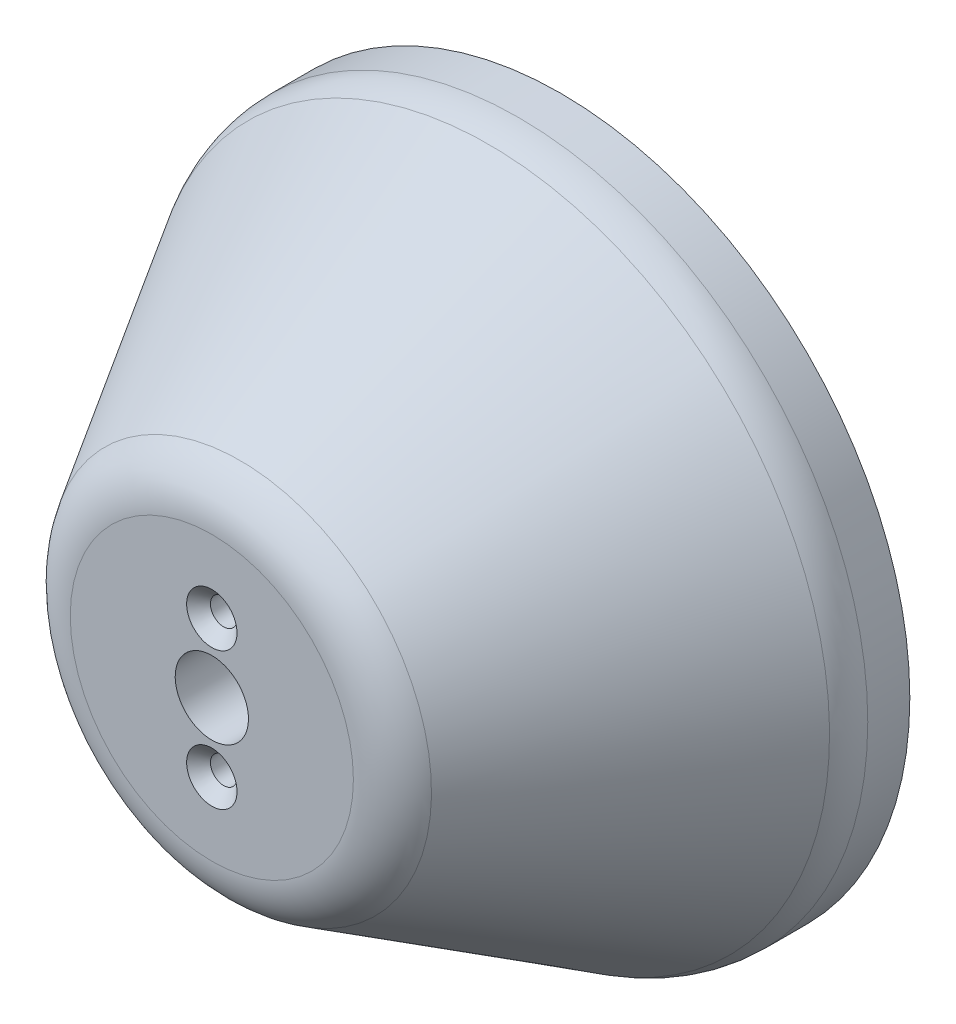
ISO-10303-21;
HEADER;
FILE_DESCRIPTION(('STEP AP214'),'2;1');
FILE_NAME('part.step','',(''),(''),'','','');
FILE_SCHEMA(('AUTOMOTIVE_DESIGN { 1 0 10303 214 1 1 1 1 }'));
ENDSEC;
DATA;
#1=APPLICATION_CONTEXT('core data for automotive mechanical design processes');
#2=APPLICATION_PROTOCOL_DEFINITION('international standard','automotive_design',2000,#1);
#3=PRODUCT_CONTEXT('',#1,'mechanical');
#4=PRODUCT('Part','Part','',(#3));
#5=PRODUCT_RELATED_PRODUCT_CATEGORY('part','',(#4));
#6=PRODUCT_DEFINITION_FORMATION('','',#4);
#7=PRODUCT_DEFINITION_CONTEXT('part definition',#1,'design');
#8=PRODUCT_DEFINITION('design','',#6,#7);
#9=PRODUCT_DEFINITION_SHAPE('','',#8);
#10=(LENGTH_UNIT() NAMED_UNIT(*) SI_UNIT(.MILLI.,.METRE.));
#11=(NAMED_UNIT(*) PLANE_ANGLE_UNIT() SI_UNIT($,.RADIAN.));
#12=(NAMED_UNIT(*) SI_UNIT($,.STERADIAN.) SOLID_ANGLE_UNIT());
#13=UNCERTAINTY_MEASURE_WITH_UNIT(LENGTH_MEASURE(1.E-05),#10,'distance_accuracy_value','');
#14=(GEOMETRIC_REPRESENTATION_CONTEXT(3) GLOBAL_UNCERTAINTY_ASSIGNED_CONTEXT((#13)) GLOBAL_UNIT_ASSIGNED_CONTEXT((#10,
#11,#12)) REPRESENTATION_CONTEXT('',''));
#15=CARTESIAN_POINT('',(0.,0.,0.));
#16=DIRECTION('',(0.,0.,1.));
#17=DIRECTION('',(1.,0.,0.));
#18=AXIS2_PLACEMENT_3D('',#15,#16,#17);
#19=CARTESIAN_POINT('',(0.,0.,38.1));
#20=DIRECTION('',(0.,0.,1.));
#21=DIRECTION('',(0.,-1.,0.));
#22=AXIS2_PLACEMENT_3D('',#19,#20,#21);
#23=PLANE('',#22);
#24=CARTESIAN_POINT('',(0.,0.,38.1));
#25=DIRECTION('',(0.,0.,1.));
#26=DIRECTION('',(0.,-1.,0.));
#27=AXIS2_PLACEMENT_3D('',#24,#25,#26);
#28=CIRCLE('',#27,15.4546910935465);
#29=CARTESIAN_POINT('',(0.,-15.4546910935465,38.1));
#30=VERTEX_POINT('',#29);
#31=EDGE_CURVE('E11',#30,#30,#28,.T.);
#32=ORIENTED_EDGE('',*,*,#31,.T.);
#33=EDGE_LOOP('',(#32));
#34=FACE_BOUND('',#33,.T.);
#35=CARTESIAN_POINT('',(0.,7.5,38.1));
#36=DIRECTION('',(0.,0.,1.));
#37=DIRECTION('',(1.,0.,0.));
#38=AXIS2_PLACEMENT_3D('',#35,#36,#37);
#39=CIRCLE('',#38,2.75);
#40=CARTESIAN_POINT('',(2.75,7.5,38.1));
#41=VERTEX_POINT('',#40);
#42=EDGE_CURVE('E120',#41,#41,#39,.T.);
#43=ORIENTED_EDGE('',*,*,#42,.F.);
#44=EDGE_LOOP('',(#43));
#45=FACE_BOUND('',#44,.T.);
#46=CARTESIAN_POINT('',(0.,-7.5,38.1));
#47=DIRECTION('',(0.,0.,1.));
#48=DIRECTION('',(1.,0.,0.));
#49=AXIS2_PLACEMENT_3D('',#46,#47,#48);
#50=CIRCLE('',#49,2.75);
#51=CARTESIAN_POINT('',(2.75,-7.5,38.1));
#52=VERTEX_POINT('',#51);
#53=EDGE_CURVE('E129',#52,#52,#50,.T.);
#54=ORIENTED_EDGE('',*,*,#53,.F.);
#55=EDGE_LOOP('',(#54));
#56=FACE_BOUND('',#55,.T.);
#57=CARTESIAN_POINT('',(0.,0.,38.1));
#58=DIRECTION('',(0.,0.,-1.));
#59=DIRECTION('',(0.,1.,0.));
#60=AXIS2_PLACEMENT_3D('',#57,#58,#59);
#61=CIRCLE('',#60,4.);
#62=CARTESIAN_POINT('',(0.,4.,38.1));
#63=VERTEX_POINT('',#62);
#64=EDGE_CURVE('E146',#63,#63,#61,.T.);
#65=ORIENTED_EDGE('',*,*,#64,.T.);
#66=EDGE_LOOP('',(#65));
#67=FACE_BOUND('',#66,.T.);
#68=ADVANCED_FACE('F44',(#34,#45,#56,#67),#23,.T.);
#69=CARTESIAN_POINT('',(0.,0.,6.35));
#70=DIRECTION('',(0.,0.,-1.));
#71=DIRECTION('',(0.,1.,0.));
#72=AXIS2_PLACEMENT_3D('',#69,#70,#71);
#73=CONICAL_SURFACE('',#72,38.1,0.540419500270584);
#74=CARTESIAN_POINT('',(0.,0.,7.85819986954223));
#75=DIRECTION('',(0.,0.,1.));
#76=DIRECTION('',(0.,-1.,0.));
#77=AXIS2_PLACEMENT_3D('',#74,#75,#76);
#78=CIRCLE('',#77,37.1950800782747);
#79=CARTESIAN_POINT('',(0.,-37.1950800782747,7.85819986954222));
#80=VERTEX_POINT('',#79);
#81=EDGE_CURVE('E53',#80,#80,#78,.T.);
#82=ORIENTED_EDGE('',*,*,#81,.T.);
#83=EDGE_LOOP('',(#82));
#84=FACE_BOUND('',#83,.T.);
#85=CARTESIAN_POINT('',(0.,0.,35.0170480469648));
#86=DIRECTION('',(0.,0.,1.));
#87=DIRECTION('',(0.,-1.,0.));
#88=AXIS2_PLACEMENT_3D('',#85,#86,#87);
#89=CIRCLE('',#88,20.8997711718211);
#90=CARTESIAN_POINT('',(0.,-20.8997711718211,35.0170480469648));
#91=VERTEX_POINT('',#90);
#92=EDGE_CURVE('E232',#91,#91,#89,.F.);
#93=ORIENTED_EDGE('',*,*,#92,.T.);
#94=EDGE_LOOP('',(#93));
#95=FACE_BOUND('',#94,.T.);
#96=ADVANCED_FACE('F240',(#84,#95),#73,.T.);
#97=CARTESIAN_POINT('',(0.,0.,0.));
#98=DIRECTION('',(0.,0.,-1.));
#99=DIRECTION('',(0.,1.,0.));
#100=AXIS2_PLACEMENT_3D('',#97,#98,#99);
#101=CYLINDRICAL_SURFACE('',#100,38.1);
#102=CARTESIAN_POINT('',(0.,0.,4.59115182257744));
#103=DIRECTION('',(0.,0.,1.));
#104=DIRECTION('',(0.,-1.,0.));
#105=AXIS2_PLACEMENT_3D('',#102,#103,#104);
#106=CIRCLE('',#105,38.1);
#107=CARTESIAN_POINT('',(0.,-38.1,4.59115182257744));
#108=VERTEX_POINT('',#107);
#109=EDGE_CURVE('E228',#108,#108,#106,.F.);
#110=ORIENTED_EDGE('',*,*,#109,.T.);
#111=EDGE_LOOP('',(#110));
#112=FACE_BOUND('',#111,.T.);
#113=CARTESIAN_POINT('',(0.,0.,0.));
#114=DIRECTION('',(0.,0.,-1.));
#115=DIRECTION('',(0.,1.,0.));
#116=AXIS2_PLACEMENT_3D('',#113,#114,#115);
#117=CIRCLE('',#116,38.1);
#118=CARTESIAN_POINT('',(0.,38.1,0.));
#119=VERTEX_POINT('',#118);
#120=EDGE_CURVE('E154',#119,#119,#117,.T.);
#121=ORIENTED_EDGE('',*,*,#120,.F.);
#122=EDGE_LOOP('',(#121));
#123=FACE_BOUND('',#122,.T.);
#124=ADVANCED_FACE('F249',(#112,#123),#101,.T.);
#125=CARTESIAN_POINT('',(0.,38.1,0.));
#126=DIRECTION('',(0.,0.,-1.));
#127=DIRECTION('',(0.,1.,0.));
#128=AXIS2_PLACEMENT_3D('',#125,#126,#127);
#129=PLANE('',#128);
#130=CARTESIAN_POINT('',(-28.5114292872175,-6.3499999999997,0.));
#131=DIRECTION('',(0.,0.,-1.));
#132=DIRECTION('',(0.,1.,0.));
#133=AXIS2_PLACEMENT_3D('',#130,#131,#132);
#134=CIRCLE('',#133,3.27917572527012);
#135=CARTESIAN_POINT('',(-28.5114292872175,-3.07082427472958,0.));
#136=VERTEX_POINT('',#135);
#137=EDGE_CURVE('E220',#136,#136,#134,.F.);
#138=ORIENTED_EDGE('',*,*,#137,.T.);
#139=EDGE_LOOP('',(#138));
#140=FACE_BOUND('',#139,.T.);
#141=CARTESIAN_POINT('',(-28.5114292872174,6.3500000000003,0.));
#142=DIRECTION('',(0.,0.,-1.));
#143=DIRECTION('',(0.,1.,0.));
#144=AXIS2_PLACEMENT_3D('',#141,#142,#143);
#145=CIRCLE('',#144,3.27917572527012);
#146=CARTESIAN_POINT('',(-28.5114292872174,9.62917572527042,0.));
#147=VERTEX_POINT('',#146);
#148=EDGE_CURVE('E216',#147,#147,#145,.F.);
#149=ORIENTED_EDGE('',*,*,#148,.T.);
#150=EDGE_LOOP('',(#149));
#151=FACE_BOUND('',#150,.T.);
#152=CARTESIAN_POINT('',(6.35,-28.5114292872174,0.));
#153=DIRECTION('',(0.,0.,-1.));
#154=DIRECTION('',(0.,1.,0.));
#155=AXIS2_PLACEMENT_3D('',#152,#153,#154);
#156=CIRCLE('',#155,3.27917572527013);
#157=CARTESIAN_POINT('',(6.35,-25.2322535619473,0.));
#158=VERTEX_POINT('',#157);
#159=EDGE_CURVE('E204',#158,#158,#156,.F.);
#160=ORIENTED_EDGE('',*,*,#159,.T.);
#161=EDGE_LOOP('',(#160));
#162=FACE_BOUND('',#161,.T.);
#163=CARTESIAN_POINT('',(-6.35,-28.5114292872174,0.));
#164=DIRECTION('',(0.,0.,-1.));
#165=DIRECTION('',(0.,1.,0.));
#166=AXIS2_PLACEMENT_3D('',#163,#164,#165);
#167=CIRCLE('',#166,3.27917572527012);
#168=CARTESIAN_POINT('',(-6.35,-25.2322535619473,0.));
#169=VERTEX_POINT('',#168);
#170=EDGE_CURVE('E200',#169,#169,#167,.F.);
#171=ORIENTED_EDGE('',*,*,#170,.T.);
#172=EDGE_LOOP('',(#171));
#173=FACE_BOUND('',#172,.T.);
#174=CARTESIAN_POINT('',(28.5114292872174,6.3499999999999,0.));
#175=DIRECTION('',(0.,0.,-1.));
#176=DIRECTION('',(0.,1.,0.));
#177=AXIS2_PLACEMENT_3D('',#174,#175,#176);
#178=CIRCLE('',#177,3.27917572527012);
#179=CARTESIAN_POINT('',(28.5114292872174,9.62917572527003,0.));
#180=VERTEX_POINT('',#179);
#181=EDGE_CURVE('E188',#180,#180,#178,.F.);
#182=ORIENTED_EDGE('',*,*,#181,.T.);
#183=EDGE_LOOP('',(#182));
#184=FACE_BOUND('',#183,.T.);
#185=CARTESIAN_POINT('',(28.5114292872174,-6.3500000000001,0.));
#186=DIRECTION('',(0.,0.,-1.));
#187=DIRECTION('',(0.,1.,0.));
#188=AXIS2_PLACEMENT_3D('',#185,#186,#187);
#189=CIRCLE('',#188,3.27917572527012);
#190=CARTESIAN_POINT('',(28.5114292872174,-3.07082427472997,0.));
#191=VERTEX_POINT('',#190);
#192=EDGE_CURVE('E184',#191,#191,#189,.F.);
#193=ORIENTED_EDGE('',*,*,#192,.T.);
#194=EDGE_LOOP('',(#193));
#195=FACE_BOUND('',#194,.T.);
#196=CARTESIAN_POINT('',(-6.35,28.5114292872174,0.));
#197=DIRECTION('',(0.,0.,-1.));
#198=DIRECTION('',(0.,1.,0.));
#199=AXIS2_PLACEMENT_3D('',#196,#197,#198);
#200=CIRCLE('',#199,3.27917572527012);
#201=CARTESIAN_POINT('',(-6.35,31.7906050124875,0.));
#202=VERTEX_POINT('',#201);
#203=EDGE_CURVE('E172',#202,#202,#200,.F.);
#204=ORIENTED_EDGE('',*,*,#203,.T.);
#205=EDGE_LOOP('',(#204));
#206=FACE_BOUND('',#205,.T.);
#207=CARTESIAN_POINT('',(6.35,28.5114292872174,0.));
#208=DIRECTION('',(0.,0.,-1.));
#209=DIRECTION('',(0.,1.,0.));
#210=AXIS2_PLACEMENT_3D('',#207,#208,#209);
#211=CIRCLE('',#210,3.27917572527012);
#212=CARTESIAN_POINT('',(6.35,31.7906050124876,0.));
#213=VERTEX_POINT('',#212);
#214=EDGE_CURVE('E168',#213,#213,#211,.F.);
#215=ORIENTED_EDGE('',*,*,#214,.T.);
#216=EDGE_LOOP('',(#215));
#217=FACE_BOUND('',#216,.T.);
#218=CARTESIAN_POINT('',(0.,0.,0.));
#219=DIRECTION('',(0.,0.,-1.));
#220=DIRECTION('',(0.,1.,0.));
#221=AXIS2_PLACEMENT_3D('',#218,#219,#220);
#222=CIRCLE('',#221,14.2875);
#223=CARTESIAN_POINT('',(0.,14.2875,0.));
#224=VERTEX_POINT('',#223);
#225=EDGE_CURVE('E150',#224,#224,#222,.T.);
#226=ORIENTED_EDGE('',*,*,#225,.F.);
#227=EDGE_LOOP('',(#226));
#228=FACE_BOUND('',#227,.T.);
#229=ORIENTED_EDGE('',*,*,#120,.T.);
#230=EDGE_LOOP('',(#229));
#231=FACE_BOUND('',#230,.T.);
#232=ADVANCED_FACE('F252',(#140,#151,#162,#173,#184,#195,#206,#217,#228,#231),#129,.T.);
#233=CARTESIAN_POINT('',(0.,0.,0.));
#234=DIRECTION('',(0.,0.,-1.));
#235=DIRECTION('',(0.,1.,0.));
#236=AXIS2_PLACEMENT_3D('',#233,#234,#235);
#237=CYLINDRICAL_SURFACE('',#236,14.2875);
#238=CARTESIAN_POINT('',(0.,0.,31.75));
#239=DIRECTION('',(0.,0.,-1.));
#240=DIRECTION('',(0.,1.,0.));
#241=AXIS2_PLACEMENT_3D('',#238,#239,#240);
#242=CIRCLE('',#241,14.2875);
#243=CARTESIAN_POINT('',(0.,14.2875,31.75));
#244=VERTEX_POINT('',#243);
#245=EDGE_CURVE('E138',#244,#244,#242,.T.);
#246=ORIENTED_EDGE('',*,*,#245,.F.);
#247=EDGE_LOOP('',(#246));
#248=FACE_BOUND('',#247,.T.);
#249=ORIENTED_EDGE('',*,*,#225,.T.);
#250=EDGE_LOOP('',(#249));
#251=FACE_BOUND('',#250,.T.);
#252=ADVANCED_FACE('F257',(#248,#251),#237,.F.);
#253=CARTESIAN_POINT('',(0.,0.,0.));
#254=DIRECTION('',(0.,0.,-1.));
#255=DIRECTION('',(0.,1.,0.));
#256=AXIS2_PLACEMENT_3D('',#253,#254,#255);
#257=CYLINDRICAL_SURFACE('',#256,4.);
#258=ORIENTED_EDGE('',*,*,#64,.F.);
#259=EDGE_LOOP('',(#258));
#260=FACE_BOUND('',#259,.T.);
#261=CARTESIAN_POINT('',(0.,0.,31.75));
#262=DIRECTION('',(0.,0.,-1.));
#263=DIRECTION('',(0.,1.,0.));
#264=AXIS2_PLACEMENT_3D('',#261,#262,#263);
#265=CIRCLE('',#264,4.);
#266=CARTESIAN_POINT('',(0.,4.,31.75));
#267=VERTEX_POINT('',#266);
#268=EDGE_CURVE('E142',#267,#267,#265,.T.);
#269=ORIENTED_EDGE('',*,*,#268,.T.);
#270=EDGE_LOOP('',(#269));
#271=FACE_BOUND('',#270,.T.);
#272=ADVANCED_FACE('F263',(#260,#271),#257,.F.);
#273=CARTESIAN_POINT('',(0.,14.2875,31.75));
#274=DIRECTION('',(0.,0.,1.));
#275=DIRECTION('',(0.,-1.,0.));
#276=AXIS2_PLACEMENT_3D('',#273,#274,#275);
#277=PLANE('',#276);
#278=CARTESIAN_POINT('',(0.,7.5,31.75));
#279=DIRECTION('',(0.,0.,1.));
#280=DIRECTION('',(0.,-1.,0.));
#281=AXIS2_PLACEMENT_3D('',#278,#279,#280);
#282=CIRCLE('',#281,1.44999999999999);
#283=CARTESIAN_POINT('',(0.,6.05000000000001,31.75));
#284=VERTEX_POINT('',#283);
#285=EDGE_CURVE('E128',#284,#284,#282,.T.);
#286=ORIENTED_EDGE('',*,*,#285,.T.);
#287=EDGE_LOOP('',(#286));
#288=FACE_BOUND('',#287,.T.);
#289=CARTESIAN_POINT('',(0.,-7.5,31.75));
#290=DIRECTION('',(0.,0.,1.));
#291=DIRECTION('',(0.,-1.,0.));
#292=AXIS2_PLACEMENT_3D('',#289,#290,#291);
#293=CIRCLE('',#292,1.44999999999999);
#294=CARTESIAN_POINT('',(0.,-8.94999999999999,31.75));
#295=VERTEX_POINT('',#294);
#296=EDGE_CURVE('E137',#295,#295,#293,.T.);
#297=ORIENTED_EDGE('',*,*,#296,.T.);
#298=EDGE_LOOP('',(#297));
#299=FACE_BOUND('',#298,.T.);
#300=ORIENTED_EDGE('',*,*,#268,.F.);
#301=EDGE_LOOP('',(#300));
#302=FACE_BOUND('',#301,.T.);
#303=ORIENTED_EDGE('',*,*,#245,.T.);
#304=EDGE_LOOP('',(#303));
#305=FACE_BOUND('',#304,.T.);
#306=ADVANCED_FACE('F409',(#288,#299,#302,#305),#277,.F.);
#307=CARTESIAN_POINT('',(0.,-7.5,38.1));
#308=DIRECTION('',(0.,0.,1.));
#309=DIRECTION('',(1.,0.,0.));
#310=AXIS2_PLACEMENT_3D('',#307,#308,#309);
#311=CYLINDRICAL_SURFACE('',#310,1.44999999999999);
#312=CARTESIAN_POINT('',(0.,-7.5,36.8));
#313=DIRECTION('',(0.,0.,1.));
#314=DIRECTION('',(1.,0.,0.));
#315=AXIS2_PLACEMENT_3D('',#312,#313,#314);
#316=CIRCLE('',#315,1.44999999999999);
#317=CARTESIAN_POINT('',(1.44999999999999,-7.5,36.8));
#318=VERTEX_POINT('',#317);
#319=EDGE_CURVE('E133',#318,#318,#316,.T.);
#320=ORIENTED_EDGE('',*,*,#319,.T.);
#321=EDGE_LOOP('',(#320));
#322=FACE_BOUND('',#321,.T.);
#323=ORIENTED_EDGE('',*,*,#296,.F.);
#324=EDGE_LOOP('',(#323));
#325=FACE_BOUND('',#324,.T.);
#326=ADVANCED_FACE('F405',(#322,#325),#311,.F.);
#327=CARTESIAN_POINT('',(0.,-7.5,38.1));
#328=DIRECTION('',(0.,0.,1.));
#329=DIRECTION('',(1.,0.,0.));
#330=AXIS2_PLACEMENT_3D('',#327,#328,#329);
#331=CONICAL_SURFACE('',#330,2.75,0.785398163397449);
#332=ORIENTED_EDGE('',*,*,#319,.F.);
#333=EDGE_LOOP('',(#332));
#334=FACE_BOUND('',#333,.T.);
#335=ORIENTED_EDGE('',*,*,#53,.T.);
#336=EDGE_LOOP('',(#335));
#337=FACE_BOUND('',#336,.T.);
#338=ADVANCED_FACE('F401',(#334,#337),#331,.F.);
#339=CARTESIAN_POINT('',(0.,7.5,38.1));
#340=DIRECTION('',(0.,0.,1.));
#341=DIRECTION('',(1.,0.,0.));
#342=AXIS2_PLACEMENT_3D('',#339,#340,#341);
#343=CYLINDRICAL_SURFACE('',#342,1.44999999999999);
#344=CARTESIAN_POINT('',(0.,7.5,36.8));
#345=DIRECTION('',(0.,0.,1.));
#346=DIRECTION('',(1.,0.,0.));
#347=AXIS2_PLACEMENT_3D('',#344,#345,#346);
#348=CIRCLE('',#347,1.44999999999999);
#349=CARTESIAN_POINT('',(1.44999999999999,7.5,36.8));
#350=VERTEX_POINT('',#349);
#351=EDGE_CURVE('E124',#350,#350,#348,.T.);
#352=ORIENTED_EDGE('',*,*,#351,.T.);
#353=EDGE_LOOP('',(#352));
#354=FACE_BOUND('',#353,.T.);
#355=ORIENTED_EDGE('',*,*,#285,.F.);
#356=EDGE_LOOP('',(#355));
#357=FACE_BOUND('',#356,.T.);
#358=ADVANCED_FACE('F397',(#354,#357),#343,.F.);
#359=CARTESIAN_POINT('',(0.,7.5,38.1));
#360=DIRECTION('',(0.,0.,1.));
#361=DIRECTION('',(1.,0.,0.));
#362=AXIS2_PLACEMENT_3D('',#359,#360,#361);
#363=CONICAL_SURFACE('',#362,2.75,0.785398163397449);
#364=ORIENTED_EDGE('',*,*,#351,.F.);
#365=EDGE_LOOP('',(#364));
#366=FACE_BOUND('',#365,.T.);
#367=ORIENTED_EDGE('',*,*,#42,.T.);
#368=EDGE_LOOP('',(#367));
#369=FACE_BOUND('',#368,.T.);
#370=ADVANCED_FACE('F394',(#366,#369),#363,.F.);
#371=CARTESIAN_POINT('',(-6.35,28.5114292872174,9.525));
#372=DIRECTION('',(0.,0.,-1.));
#373=DIRECTION('',(0.,1.,0.));
#374=AXIS2_PLACEMENT_3D('',#371,#372,#373);
#375=CONICAL_SURFACE('',#374,2.60985,1.02974425867665);
#376=CARTESIAN_POINT('',(-6.35,28.5114292872174,11.0931560865691));
#377=VERTEX_POINT('',#376);
#378=VERTEX_LOOP('',#377);
#379=FACE_BOUND('',#378,.T.);
#380=CARTESIAN_POINT('',(-6.35,28.5114292872174,9.525));
#381=DIRECTION('',(0.,0.,-1.));
#382=DIRECTION('',(0.,1.,0.));
#383=AXIS2_PLACEMENT_3D('',#380,#381,#382);
#384=CIRCLE('',#383,2.60985);
#385=CARTESIAN_POINT('',(-6.35,31.1212792872174,9.525));
#386=VERTEX_POINT('',#385);
#387=EDGE_CURVE('E116',#386,#386,#384,.T.);
#388=ORIENTED_EDGE('',*,*,#387,.T.);
#389=EDGE_LOOP('',(#388));
#390=FACE_BOUND('',#389,.T.);
#391=ADVANCED_FACE('F390',(#379,#390),#375,.F.);
#392=CARTESIAN_POINT('',(-6.35,28.5114292872174,0.));
#393=DIRECTION('',(0.,0.,-1.));
#394=DIRECTION('',(0.,1.,0.));
#395=AXIS2_PLACEMENT_3D('',#392,#393,#394);
#396=CYLINDRICAL_SURFACE('',#395,2.60985);
#397=CARTESIAN_POINT('',(-6.35,28.5114292872174,4.76250000000002));
#398=DIRECTION('',(0.,0.,-1.));
#399=DIRECTION('',(-1.,0.,0.));
#400=AXIS2_PLACEMENT_3D('',#397,#398,#399);
#401=CIRCLE('',#400,2.60985);
#402=CARTESIAN_POINT('',(-8.95985,28.5114292872174,4.76250000000002));
#403=VERTEX_POINT('',#402);
#404=EDGE_CURVE('E158',#403,#403,#401,.T.);
#405=ORIENTED_EDGE('',*,*,#404,.T.);
#406=EDGE_LOOP('',(#405));
#407=FACE_BOUND('',#406,.T.);
#408=ORIENTED_EDGE('',*,*,#387,.F.);
#409=EDGE_LOOP('',(#408));
#410=FACE_BOUND('',#409,.T.);
#411=ADVANCED_FACE('F387',(#407,#410),#396,.F.);
#412=CARTESIAN_POINT('',(6.35,28.5114292872174,9.525));
#413=DIRECTION('',(0.,0.,-1.));
#414=DIRECTION('',(0.,1.,0.));
#415=AXIS2_PLACEMENT_3D('',#412,#413,#414);
#416=CONICAL_SURFACE('',#415,2.60985,1.02974425867665);
#417=CARTESIAN_POINT('',(6.35,28.5114292872174,11.0931560865691));
#418=VERTEX_POINT('',#417);
#419=VERTEX_LOOP('',#418);
#420=FACE_BOUND('',#419,.T.);
#421=CARTESIAN_POINT('',(6.35,28.5114292872174,9.525));
#422=DIRECTION('',(0.,0.,-1.));
#423=DIRECTION('',(0.,1.,0.));
#424=AXIS2_PLACEMENT_3D('',#421,#422,#423);
#425=CIRCLE('',#424,2.60985);
#426=CARTESIAN_POINT('',(6.35,31.1212792872174,9.525));
#427=VERTEX_POINT('',#426);
#428=EDGE_CURVE('E112',#427,#427,#425,.T.);
#429=ORIENTED_EDGE('',*,*,#428,.T.);
#430=EDGE_LOOP('',(#429));
#431=FACE_BOUND('',#430,.T.);
#432=ADVANCED_FACE('F383',(#420,#431),#416,.F.);
#433=CARTESIAN_POINT('',(6.35,28.5114292872174,0.));
#434=DIRECTION('',(0.,0.,-1.));
#435=DIRECTION('',(0.,1.,0.));
#436=AXIS2_PLACEMENT_3D('',#433,#434,#435);
#437=CYLINDRICAL_SURFACE('',#436,2.60985);
#438=CARTESIAN_POINT('',(6.35,28.5114292872174,4.76250000000002));
#439=DIRECTION('',(0.,0.,-1.));
#440=DIRECTION('',(-1.,0.,0.));
#441=AXIS2_PLACEMENT_3D('',#438,#439,#440);
#442=CIRCLE('',#441,2.60985);
#443=CARTESIAN_POINT('',(3.74015,28.5114292872174,4.76250000000002));
#444=VERTEX_POINT('',#443);
#445=EDGE_CURVE('E176',#444,#444,#442,.T.);
#446=ORIENTED_EDGE('',*,*,#445,.T.);
#447=EDGE_LOOP('',(#446));
#448=FACE_BOUND('',#447,.T.);
#449=ORIENTED_EDGE('',*,*,#428,.F.);
#450=EDGE_LOOP('',(#449));
#451=FACE_BOUND('',#450,.T.);
#452=ADVANCED_FACE('F284',(#448,#451),#437,.F.);
#453=CARTESIAN_POINT('',(-6.35,28.5114292872174,4.76250000000002));
#454=DIRECTION('',(0.,0.,-1.));
#455=DIRECTION('',(-1.,0.,0.));
#456=AXIS2_PLACEMENT_3D('',#453,#454,#455);
#457=CONICAL_SURFACE('',#456,2.60985,0.139626340159542);
#458=ORIENTED_EDGE('',*,*,#203,.F.);
#459=EDGE_LOOP('',(#458));
#460=FACE_BOUND('',#459,.T.);
#461=ORIENTED_EDGE('',*,*,#404,.F.);
#462=EDGE_LOOP('',(#461));
#463=FACE_BOUND('',#462,.T.);
#464=ADVANCED_FACE('F277',(#460,#463),#457,.F.);
#465=CARTESIAN_POINT('',(6.35,28.5114292872174,4.76250000000002));
#466=DIRECTION('',(0.,0.,-1.));
#467=DIRECTION('',(-1.,0.,0.));
#468=AXIS2_PLACEMENT_3D('',#465,#466,#467);
#469=CONICAL_SURFACE('',#468,2.60985,0.139626340159543);
#470=ORIENTED_EDGE('',*,*,#214,.F.);
#471=EDGE_LOOP('',(#470));
#472=FACE_BOUND('',#471,.T.);
#473=ORIENTED_EDGE('',*,*,#445,.F.);
#474=EDGE_LOOP('',(#473));
#475=FACE_BOUND('',#474,.T.);
#476=ADVANCED_FACE('F283',(#472,#475),#469,.F.);
#477=CARTESIAN_POINT('',(28.5114292872174,6.3499999999999,9.525));
#478=DIRECTION('',(0.,0.,-1.));
#479=DIRECTION('',(0.,1.,0.));
#480=AXIS2_PLACEMENT_3D('',#477,#478,#479);
#481=CONICAL_SURFACE('',#480,2.60985,1.02974425867665);
#482=CARTESIAN_POINT('',(28.5114292872174,6.3499999999999,11.0931560865691));
#483=VERTEX_POINT('',#482);
#484=VERTEX_LOOP('',#483);
#485=FACE_BOUND('',#484,.T.);
#486=CARTESIAN_POINT('',(28.5114292872174,6.3499999999999,9.525));
#487=DIRECTION('',(0.,0.,-1.));
#488=DIRECTION('',(0.,1.,0.));
#489=AXIS2_PLACEMENT_3D('',#486,#487,#488);
#490=CIRCLE('',#489,2.60985);
#491=CARTESIAN_POINT('',(28.5114292872174,8.9598499999999,9.525));
#492=VERTEX_POINT('',#491);
#493=EDGE_CURVE('E108',#492,#492,#490,.T.);
#494=ORIENTED_EDGE('',*,*,#493,.T.);
#495=EDGE_LOOP('',(#494));
#496=FACE_BOUND('',#495,.T.);
#497=ADVANCED_FACE('F291',(#485,#496),#481,.F.);
#498=CARTESIAN_POINT('',(28.5114292872174,6.3499999999999,0.));
#499=DIRECTION('',(0.,0.,-1.));
#500=DIRECTION('',(0.,1.,0.));
#501=AXIS2_PLACEMENT_3D('',#498,#499,#500);
#502=CYLINDRICAL_SURFACE('',#501,2.60985);
#503=CARTESIAN_POINT('',(28.5114292872174,6.3499999999999,4.76250000000001));
#504=DIRECTION('',(0.,0.,-1.));
#505=DIRECTION('',(0.,1.,0.));
#506=AXIS2_PLACEMENT_3D('',#503,#504,#505);
#507=CIRCLE('',#506,2.60985);
#508=CARTESIAN_POINT('',(28.5114292872174,8.9598499999999,4.76250000000001));
#509=VERTEX_POINT('',#508);
#510=EDGE_CURVE('E180',#509,#509,#507,.T.);
#511=ORIENTED_EDGE('',*,*,#510,.T.);
#512=EDGE_LOOP('',(#511));
#513=FACE_BOUND('',#512,.T.);
#514=ORIENTED_EDGE('',*,*,#493,.F.);
#515=EDGE_LOOP('',(#514));
#516=FACE_BOUND('',#515,.T.);
#517=ADVANCED_FACE('F373',(#513,#516),#502,.F.);
#518=CARTESIAN_POINT('',(28.5114292872174,-6.3500000000001,9.525));
#519=DIRECTION('',(0.,0.,-1.));
#520=DIRECTION('',(0.,1.,0.));
#521=AXIS2_PLACEMENT_3D('',#518,#519,#520);
#522=CONICAL_SURFACE('',#521,2.60985,1.02974425867665);
#523=CARTESIAN_POINT('',(28.5114292872174,-6.3500000000001,11.0931560865691));
#524=VERTEX_POINT('',#523);
#525=VERTEX_LOOP('',#524);
#526=FACE_BOUND('',#525,.T.);
#527=CARTESIAN_POINT('',(28.5114292872174,-6.3500000000001,9.525));
#528=DIRECTION('',(0.,0.,-1.));
#529=DIRECTION('',(0.,1.,0.));
#530=AXIS2_PLACEMENT_3D('',#527,#528,#529);
#531=CIRCLE('',#530,2.60985);
#532=CARTESIAN_POINT('',(28.5114292872174,-3.7401500000001,9.525));
#533=VERTEX_POINT('',#532);
#534=EDGE_CURVE('E104',#533,#533,#531,.T.);
#535=ORIENTED_EDGE('',*,*,#534,.T.);
#536=EDGE_LOOP('',(#535));
#537=FACE_BOUND('',#536,.T.);
#538=ADVANCED_FACE('F369',(#526,#537),#522,.F.);
#539=CARTESIAN_POINT('',(28.5114292872174,-6.3500000000001,0.));
#540=DIRECTION('',(0.,0.,-1.));
#541=DIRECTION('',(0.,1.,0.));
#542=AXIS2_PLACEMENT_3D('',#539,#540,#541);
#543=CYLINDRICAL_SURFACE('',#542,2.60985);
#544=CARTESIAN_POINT('',(28.5114292872174,-6.3500000000001,4.76250000000002));
#545=DIRECTION('',(0.,0.,-1.));
#546=DIRECTION('',(0.,1.,0.));
#547=AXIS2_PLACEMENT_3D('',#544,#545,#546);
#548=CIRCLE('',#547,2.60985);
#549=CARTESIAN_POINT('',(28.5114292872174,-3.7401500000001,4.76250000000002));
#550=VERTEX_POINT('',#549);
#551=EDGE_CURVE('E192',#550,#550,#548,.T.);
#552=ORIENTED_EDGE('',*,*,#551,.T.);
#553=EDGE_LOOP('',(#552));
#554=FACE_BOUND('',#553,.T.);
#555=ORIENTED_EDGE('',*,*,#534,.F.);
#556=EDGE_LOOP('',(#555));
#557=FACE_BOUND('',#556,.T.);
#558=ADVANCED_FACE('F365',(#554,#557),#543,.F.);
#559=CARTESIAN_POINT('',(6.35,-28.5114292872174,9.525));
#560=DIRECTION('',(0.,0.,-1.));
#561=DIRECTION('',(0.,1.,0.));
#562=AXIS2_PLACEMENT_3D('',#559,#560,#561);
#563=CONICAL_SURFACE('',#562,2.60985,1.02974425867665);
#564=CARTESIAN_POINT('',(6.35,-28.5114292872174,11.0931560865691));
#565=VERTEX_POINT('',#564);
#566=VERTEX_LOOP('',#565);
#567=FACE_BOUND('',#566,.T.);
#568=CARTESIAN_POINT('',(6.35,-28.5114292872174,9.525));
#569=DIRECTION('',(0.,0.,-1.));
#570=DIRECTION('',(0.,1.,0.));
#571=AXIS2_PLACEMENT_3D('',#568,#569,#570);
#572=CIRCLE('',#571,2.60985);
#573=CARTESIAN_POINT('',(6.35,-25.9015792872174,9.525));
#574=VERTEX_POINT('',#573);
#575=EDGE_CURVE('E100',#574,#574,#572,.T.);
#576=ORIENTED_EDGE('',*,*,#575,.T.);
#577=EDGE_LOOP('',(#576));
#578=FACE_BOUND('',#577,.T.);
#579=ADVANCED_FACE('F361',(#567,#578),#563,.F.);
#580=CARTESIAN_POINT('',(6.35,-28.5114292872174,0.));
#581=DIRECTION('',(0.,0.,-1.));
#582=DIRECTION('',(0.,1.,0.));
#583=AXIS2_PLACEMENT_3D('',#580,#581,#582);
#584=CYLINDRICAL_SURFACE('',#583,2.60985);
#585=CARTESIAN_POINT('',(6.35,-28.5114292872174,4.76250000000001));
#586=DIRECTION('',(0.,0.,-1.));
#587=DIRECTION('',(-1.,0.,0.));
#588=AXIS2_PLACEMENT_3D('',#585,#586,#587);
#589=CIRCLE('',#588,2.60985);
#590=CARTESIAN_POINT('',(3.74015,-28.5114292872174,4.76250000000001));
#591=VERTEX_POINT('',#590);
#592=EDGE_CURVE('E196',#591,#591,#589,.T.);
#593=ORIENTED_EDGE('',*,*,#592,.T.);
#594=EDGE_LOOP('',(#593));
#595=FACE_BOUND('',#594,.T.);
#596=ORIENTED_EDGE('',*,*,#575,.F.);
#597=EDGE_LOOP('',(#596));
#598=FACE_BOUND('',#597,.T.);
#599=ADVANCED_FACE('F357',(#595,#598),#584,.F.);
#600=CARTESIAN_POINT('',(-6.35,-28.5114292872174,9.525));
#601=DIRECTION('',(0.,0.,-1.));
#602=DIRECTION('',(0.,1.,0.));
#603=AXIS2_PLACEMENT_3D('',#600,#601,#602);
#604=CONICAL_SURFACE('',#603,2.60985,1.02974425867665);
#605=CARTESIAN_POINT('',(-6.35,-28.5114292872174,11.0931560865691));
#606=VERTEX_POINT('',#605);
#607=VERTEX_LOOP('',#606);
#608=FACE_BOUND('',#607,.T.);
#609=CARTESIAN_POINT('',(-6.35,-28.5114292872174,9.525));
#610=DIRECTION('',(0.,0.,-1.));
#611=DIRECTION('',(0.,1.,0.));
#612=AXIS2_PLACEMENT_3D('',#609,#610,#611);
#613=CIRCLE('',#612,2.60985);
#614=CARTESIAN_POINT('',(-6.35,-25.9015792872174,9.525));
#615=VERTEX_POINT('',#614);
#616=EDGE_CURVE('E94',#615,#615,#613,.T.);
#617=ORIENTED_EDGE('',*,*,#616,.T.);
#618=EDGE_LOOP('',(#617));
#619=FACE_BOUND('',#618,.T.);
#620=ADVANCED_FACE('F353',(#608,#619),#604,.F.);
#621=CARTESIAN_POINT('',(-6.35,-28.5114292872174,0.));
#622=DIRECTION('',(0.,0.,-1.));
#623=DIRECTION('',(0.,1.,0.));
#624=AXIS2_PLACEMENT_3D('',#621,#622,#623);
#625=CYLINDRICAL_SURFACE('',#624,2.60985);
#626=CARTESIAN_POINT('',(-6.35,-28.5114292872174,4.76250000000002));
#627=DIRECTION('',(0.,0.,-1.));
#628=DIRECTION('',(-1.,0.,0.));
#629=AXIS2_PLACEMENT_3D('',#626,#627,#628);
#630=CIRCLE('',#629,2.60985);
#631=CARTESIAN_POINT('',(-8.95985,-28.5114292872174,4.76250000000002));
#632=VERTEX_POINT('',#631);
#633=EDGE_CURVE('E208',#632,#632,#630,.T.);
#634=ORIENTED_EDGE('',*,*,#633,.T.);
#635=EDGE_LOOP('',(#634));
#636=FACE_BOUND('',#635,.T.);
#637=ORIENTED_EDGE('',*,*,#616,.F.);
#638=EDGE_LOOP('',(#637));
#639=FACE_BOUND('',#638,.T.);
#640=ADVANCED_FACE('F349',(#636,#639),#625,.F.);
#641=CARTESIAN_POINT('',(-28.5114292872175,-6.3499999999997,9.525));
#642=DIRECTION('',(0.,0.,-1.));
#643=DIRECTION('',(0.,1.,0.));
#644=AXIS2_PLACEMENT_3D('',#641,#642,#643);
#645=CONICAL_SURFACE('',#644,2.60985,1.02974425867665);
#646=CARTESIAN_POINT('',(-28.5114292872175,-6.3499999999997,11.0931560865691));
#647=VERTEX_POINT('',#646);
#648=VERTEX_LOOP('',#647);
#649=FACE_BOUND('',#648,.T.);
#650=CARTESIAN_POINT('',(-28.5114292872175,-6.3499999999997,9.525));
#651=DIRECTION('',(0.,0.,-1.));
#652=DIRECTION('',(0.,1.,0.));
#653=AXIS2_PLACEMENT_3D('',#650,#651,#652);
#654=CIRCLE('',#653,2.60985);
#655=CARTESIAN_POINT('',(-28.5114292872175,-3.74014999999971,9.525));
#656=VERTEX_POINT('',#655);
#657=EDGE_CURVE('E89',#656,#656,#654,.T.);
#658=ORIENTED_EDGE('',*,*,#657,.T.);
#659=EDGE_LOOP('',(#658));
#660=FACE_BOUND('',#659,.T.);
#661=ADVANCED_FACE('F345',(#649,#660),#645,.F.);
#662=CARTESIAN_POINT('',(-28.5114292872175,-6.3499999999997,0.));
#663=DIRECTION('',(0.,0.,-1.));
#664=DIRECTION('',(0.,1.,0.));
#665=AXIS2_PLACEMENT_3D('',#662,#663,#664);
#666=CYLINDRICAL_SURFACE('',#665,2.60985);
#667=CARTESIAN_POINT('',(-28.5114292872175,-6.3499999999997,4.76250000000003));
#668=DIRECTION('',(0.,0.,-1.));
#669=DIRECTION('',(0.,1.,0.));
#670=AXIS2_PLACEMENT_3D('',#667,#668,#669);
#671=CIRCLE('',#670,2.60985);
#672=CARTESIAN_POINT('',(-28.5114292872175,-3.74014999999971,4.76250000000004));
#673=VERTEX_POINT('',#672);
#674=EDGE_CURVE('E212',#673,#673,#671,.T.);
#675=ORIENTED_EDGE('',*,*,#674,.T.);
#676=EDGE_LOOP('',(#675));
#677=FACE_BOUND('',#676,.T.);
#678=ORIENTED_EDGE('',*,*,#657,.F.);
#679=EDGE_LOOP('',(#678));
#680=FACE_BOUND('',#679,.T.);
#681=ADVANCED_FACE('F82',(#677,#680),#666,.F.);
#682=CARTESIAN_POINT('',(-28.5114292872174,6.3500000000003,9.525));
#683=DIRECTION('',(0.,0.,-1.));
#684=DIRECTION('',(0.,1.,0.));
#685=AXIS2_PLACEMENT_3D('',#682,#683,#684);
#686=CONICAL_SURFACE('',#685,2.60985,1.02974425867665);
#687=CARTESIAN_POINT('',(-28.5114292872174,6.3500000000003,11.0931560865691));
#688=VERTEX_POINT('',#687);
#689=VERTEX_LOOP('',#688);
#690=FACE_BOUND('',#689,.T.);
#691=CARTESIAN_POINT('',(-28.5114292872174,6.3500000000003,9.525));
#692=DIRECTION('',(0.,0.,-1.));
#693=DIRECTION('',(0.,1.,0.));
#694=AXIS2_PLACEMENT_3D('',#691,#692,#693);
#695=CIRCLE('',#694,2.60985);
#696=CARTESIAN_POINT('',(-28.5114292872174,8.95985000000029,9.525));
#697=VERTEX_POINT('',#696);
#698=EDGE_CURVE('E86',#697,#697,#695,.T.);
#699=ORIENTED_EDGE('',*,*,#698,.T.);
#700=EDGE_LOOP('',(#699));
#701=FACE_BOUND('',#700,.T.);
#702=ADVANCED_FACE('F78',(#690,#701),#686,.F.);
#703=CARTESIAN_POINT('',(-28.5114292872174,6.3500000000003,0.));
#704=DIRECTION('',(0.,0.,-1.));
#705=DIRECTION('',(0.,1.,0.));
#706=AXIS2_PLACEMENT_3D('',#703,#704,#705);
#707=CYLINDRICAL_SURFACE('',#706,2.60985);
#708=CARTESIAN_POINT('',(-28.5114292872174,6.3500000000003,4.76250000000002));
#709=DIRECTION('',(0.,0.,-1.));
#710=DIRECTION('',(0.,1.,0.));
#711=AXIS2_PLACEMENT_3D('',#708,#709,#710);
#712=CIRCLE('',#711,2.60985);
#713=CARTESIAN_POINT('',(-28.5114292872174,8.9598500000003,4.76250000000002));
#714=VERTEX_POINT('',#713);
#715=EDGE_CURVE('E224',#714,#714,#712,.T.);
#716=ORIENTED_EDGE('',*,*,#715,.T.);
#717=EDGE_LOOP('',(#716));
#718=FACE_BOUND('',#717,.T.);
#719=ORIENTED_EDGE('',*,*,#698,.F.);
#720=EDGE_LOOP('',(#719));
#721=FACE_BOUND('',#720,.T.);
#722=ADVANCED_FACE('F81',(#718,#721),#707,.F.);
#723=CARTESIAN_POINT('',(28.5114292872174,6.3499999999999,4.76250000000001));
#724=DIRECTION('',(0.,0.,-1.));
#725=DIRECTION('',(0.,1.,0.));
#726=AXIS2_PLACEMENT_3D('',#723,#724,#725);
#727=CONICAL_SURFACE('',#726,2.60985,0.139626340159543);
#728=ORIENTED_EDGE('',*,*,#181,.F.);
#729=EDGE_LOOP('',(#728));
#730=FACE_BOUND('',#729,.T.);
#731=ORIENTED_EDGE('',*,*,#510,.F.);
#732=EDGE_LOOP('',(#731));
#733=FACE_BOUND('',#732,.T.);
#734=ADVANCED_FACE('F293',(#730,#733),#727,.F.);
#735=CARTESIAN_POINT('',(28.5114292872174,-6.3500000000001,4.76250000000002));
#736=DIRECTION('',(0.,0.,-1.));
#737=DIRECTION('',(0.,1.,0.));
#738=AXIS2_PLACEMENT_3D('',#735,#736,#737);
#739=CONICAL_SURFACE('',#738,2.60985,0.139626340159543);
#740=ORIENTED_EDGE('',*,*,#192,.F.);
#741=EDGE_LOOP('',(#740));
#742=FACE_BOUND('',#741,.T.);
#743=ORIENTED_EDGE('',*,*,#551,.F.);
#744=EDGE_LOOP('',(#743));
#745=FACE_BOUND('',#744,.T.);
#746=ADVANCED_FACE('F299',(#742,#745),#739,.F.);
#747=CARTESIAN_POINT('',(6.35,-28.5114292872174,4.76250000000001));
#748=DIRECTION('',(0.,0.,-1.));
#749=DIRECTION('',(-1.,0.,0.));
#750=AXIS2_PLACEMENT_3D('',#747,#748,#749);
#751=CONICAL_SURFACE('',#750,2.60985,0.139626340159544);
#752=ORIENTED_EDGE('',*,*,#159,.F.);
#753=EDGE_LOOP('',(#752));
#754=FACE_BOUND('',#753,.T.);
#755=ORIENTED_EDGE('',*,*,#592,.F.);
#756=EDGE_LOOP('',(#755));
#757=FACE_BOUND('',#756,.T.);
#758=ADVANCED_FACE('F306',(#754,#757),#751,.F.);
#759=CARTESIAN_POINT('',(-6.35,-28.5114292872174,4.76250000000001));
#760=DIRECTION('',(0.,0.,-1.));
#761=DIRECTION('',(-1.,0.,0.));
#762=AXIS2_PLACEMENT_3D('',#759,#760,#761);
#763=CONICAL_SURFACE('',#762,2.60985,0.139626340159543);
#764=ORIENTED_EDGE('',*,*,#170,.F.);
#765=EDGE_LOOP('',(#764));
#766=FACE_BOUND('',#765,.T.);
#767=ORIENTED_EDGE('',*,*,#633,.F.);
#768=EDGE_LOOP('',(#767));
#769=FACE_BOUND('',#768,.T.);
#770=ADVANCED_FACE('F313',(#766,#769),#763,.F.);
#771=CARTESIAN_POINT('',(-28.5114292872175,-6.3499999999997,4.76250000000004));
#772=DIRECTION('',(0.,0.,-1.));
#773=DIRECTION('',(0.,1.,0.));
#774=AXIS2_PLACEMENT_3D('',#771,#772,#773);
#775=CONICAL_SURFACE('',#774,2.60985,0.139626340159543);
#776=ORIENTED_EDGE('',*,*,#137,.F.);
#777=EDGE_LOOP('',(#776));
#778=FACE_BOUND('',#777,.T.);
#779=ORIENTED_EDGE('',*,*,#674,.F.);
#780=EDGE_LOOP('',(#779));
#781=FACE_BOUND('',#780,.T.);
#782=ADVANCED_FACE('F320',(#778,#781),#775,.F.);
#783=CARTESIAN_POINT('',(-28.5114292872174,6.3500000000003,4.76250000000003));
#784=DIRECTION('',(0.,0.,-1.));
#785=DIRECTION('',(0.,1.,0.));
#786=AXIS2_PLACEMENT_3D('',#783,#784,#785);
#787=CONICAL_SURFACE('',#786,2.60985,0.139626340159543);
#788=ORIENTED_EDGE('',*,*,#148,.F.);
#789=EDGE_LOOP('',(#788));
#790=FACE_BOUND('',#789,.T.);
#791=ORIENTED_EDGE('',*,*,#715,.F.);
#792=EDGE_LOOP('',(#791));
#793=FACE_BOUND('',#792,.T.);
#794=ADVANCED_FACE('F246',(#790,#793),#787,.F.);
#795=CARTESIAN_POINT('',(0.,0.,4.59115182257744));
#796=DIRECTION('',(0.,0.,1.));
#797=DIRECTION('',(0.,-1.,0.));
#798=AXIS2_PLACEMENT_3D('',#795,#796,#797);
#799=TOROIDAL_SURFACE('',#798,31.75,6.35);
#800=ORIENTED_EDGE('',*,*,#81,.F.);
#801=EDGE_LOOP('',(#800));
#802=FACE_BOUND('',#801,.T.);
#803=ORIENTED_EDGE('',*,*,#109,.F.);
#804=EDGE_LOOP('',(#803));
#805=FACE_BOUND('',#804,.T.);
#806=ADVANCED_FACE('F243',(#802,#805),#799,.T.);
#807=CARTESIAN_POINT('',(0.,0.,31.75));
#808=DIRECTION('',(0.,0.,1.));
#809=DIRECTION('',(0.,-1.,0.));
#810=AXIS2_PLACEMENT_3D('',#807,#808,#809);
#811=TOROIDAL_SURFACE('',#810,15.4546910935465,6.35);
#812=ORIENTED_EDGE('',*,*,#31,.F.);
#813=EDGE_LOOP('',(#812));
#814=FACE_BOUND('',#813,.T.);
#815=ORIENTED_EDGE('',*,*,#92,.F.);
#816=EDGE_LOOP('',(#815));
#817=FACE_BOUND('',#816,.T.);
#818=ADVANCED_FACE('F46',(#814,#817),#811,.T.);
#819=CLOSED_SHELL('',(#68,#96,#124,#232,#252,#272,#306,#326,#338,#358,#370,#391,#411,#432,#452,
#464,#476,#497,#517,#538,#558,#579,#599,#620,#640,#661,#681,#702,#722,#734,#746,#758,#770,#782,
#794,#806,#818));
#820=MANIFOLD_SOLID_BREP('B2',#819);
#821=ADVANCED_BREP_SHAPE_REPRESENTATION('',(#18,#820),#14);
#822=SHAPE_DEFINITION_REPRESENTATION(#9,#821);
ENDSEC;
END-ISO-10303-21;
